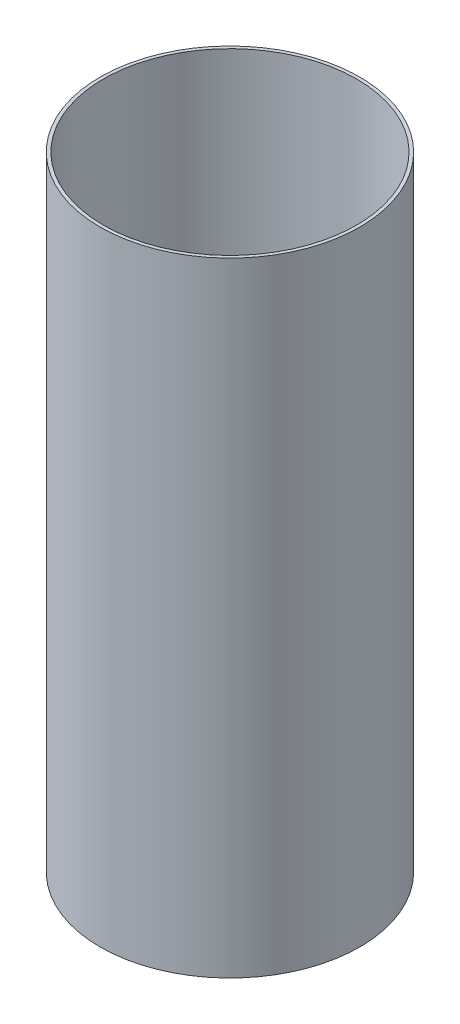
ISO-10303-21;
HEADER;
FILE_DESCRIPTION(('STEP AP214'),'2;1');
FILE_NAME('part.step','',(''),(''),'','','');
FILE_SCHEMA(('AUTOMOTIVE_DESIGN { 1 0 10303 214 1 1 1 1 }'));
ENDSEC;
DATA;
#1=APPLICATION_CONTEXT('core data for automotive mechanical design processes');
#2=APPLICATION_PROTOCOL_DEFINITION('international standard','automotive_design',2000,#1);
#3=PRODUCT_CONTEXT('',#1,'mechanical');
#4=PRODUCT('Part','Part','',(#3));
#5=PRODUCT_RELATED_PRODUCT_CATEGORY('part','',(#4));
#6=PRODUCT_DEFINITION_FORMATION('','',#4);
#7=PRODUCT_DEFINITION_CONTEXT('part definition',#1,'design');
#8=PRODUCT_DEFINITION('design','',#6,#7);
#9=PRODUCT_DEFINITION_SHAPE('','',#8);
#10=(LENGTH_UNIT() NAMED_UNIT(*) SI_UNIT(.MILLI.,.METRE.));
#11=(NAMED_UNIT(*) PLANE_ANGLE_UNIT() SI_UNIT($,.RADIAN.));
#12=(NAMED_UNIT(*) SI_UNIT($,.STERADIAN.) SOLID_ANGLE_UNIT());
#13=UNCERTAINTY_MEASURE_WITH_UNIT(LENGTH_MEASURE(1.E-05),#10,'distance_accuracy_value','');
#14=(GEOMETRIC_REPRESENTATION_CONTEXT(3) GLOBAL_UNCERTAINTY_ASSIGNED_CONTEXT((#13)) GLOBAL_UNIT_ASSIGNED_CONTEXT((#10,
#11,#12)) REPRESENTATION_CONTEXT('',''));
#15=CARTESIAN_POINT('',(0.,0.,0.));
#16=DIRECTION('',(0.,0.,1.));
#17=DIRECTION('',(1.,0.,0.));
#18=AXIS2_PLACEMENT_3D('',#15,#16,#17);
#19=CARTESIAN_POINT('',(0.,-304.8,0.));
#20=DIRECTION('',(0.,1.,0.));
#21=DIRECTION('',(0.,0.,1.));
#22=AXIS2_PLACEMENT_3D('',#19,#20,#21);
#23=CYLINDRICAL_SURFACE('',#22,127.);
#24=CARTESIAN_POINT('',(0.,-304.8,0.));
#25=DIRECTION('',(0.,1.,0.));
#26=DIRECTION('',(0.,0.,1.));
#27=AXIS2_PLACEMENT_3D('',#24,#25,#26);
#28=CIRCLE('',#27,127.);
#29=CARTESIAN_POINT('',(0.,-304.8,127.));
#30=VERTEX_POINT('',#29);
#31=EDGE_CURVE('E10',#30,#30,#28,.T.);
#32=ORIENTED_EDGE('',*,*,#31,.T.);
#33=EDGE_LOOP('',(#32));
#34=FACE_BOUND('',#33,.T.);
#35=CARTESIAN_POINT('',(0.,304.8,0.));
#36=DIRECTION('',(0.,1.,0.));
#37=DIRECTION('',(0.,0.,1.));
#38=AXIS2_PLACEMENT_3D('',#35,#36,#37);
#39=CIRCLE('',#38,127.);
#40=CARTESIAN_POINT('',(0.,304.8,127.));
#41=VERTEX_POINT('',#40);
#42=EDGE_CURVE('E43',#41,#41,#39,.T.);
#43=ORIENTED_EDGE('',*,*,#42,.F.);
#44=EDGE_LOOP('',(#43));
#45=FACE_BOUND('',#44,.T.);
#46=ADVANCED_FACE('F33',(#34,#45),#23,.T.);
#47=CARTESIAN_POINT('',(0.,-304.8,0.));
#48=DIRECTION('',(0.,1.,0.));
#49=DIRECTION('',(0.,0.,1.));
#50=AXIS2_PLACEMENT_3D('',#47,#48,#49);
#51=PLANE('',#50);
#52=CARTESIAN_POINT('',(0.,-304.8,0.));
#53=DIRECTION('',(0.,1.,0.));
#54=DIRECTION('',(0.,0.,1.));
#55=AXIS2_PLACEMENT_3D('',#52,#53,#54);
#56=CIRCLE('',#55,123.825);
#57=CARTESIAN_POINT('',(0.,-304.8,123.825));
#58=VERTEX_POINT('',#57);
#59=EDGE_CURVE('E39',#58,#58,#56,.T.);
#60=ORIENTED_EDGE('',*,*,#59,.T.);
#61=EDGE_LOOP('',(#60));
#62=FACE_BOUND('',#61,.T.);
#63=ORIENTED_EDGE('',*,*,#31,.F.);
#64=EDGE_LOOP('',(#63));
#65=FACE_BOUND('',#64,.T.);
#66=ADVANCED_FACE('F62',(#62,#65),#51,.F.);
#67=CARTESIAN_POINT('',(0.,-304.8,0.));
#68=DIRECTION('',(0.,1.,0.));
#69=DIRECTION('',(0.,0.,1.));
#70=AXIS2_PLACEMENT_3D('',#67,#68,#69);
#71=CYLINDRICAL_SURFACE('',#70,123.825);
#72=ORIENTED_EDGE('',*,*,#59,.F.);
#73=EDGE_LOOP('',(#72));
#74=FACE_BOUND('',#73,.T.);
#75=CARTESIAN_POINT('',(0.,304.8,0.));
#76=DIRECTION('',(0.,1.,0.));
#77=DIRECTION('',(0.,0.,1.));
#78=AXIS2_PLACEMENT_3D('',#75,#76,#77);
#79=CIRCLE('',#78,123.825);
#80=CARTESIAN_POINT('',(0.,304.8,123.825));
#81=VERTEX_POINT('',#80);
#82=EDGE_CURVE('E47',#81,#81,#79,.T.);
#83=ORIENTED_EDGE('',*,*,#82,.T.);
#84=EDGE_LOOP('',(#83));
#85=FACE_BOUND('',#84,.T.);
#86=ADVANCED_FACE('F53',(#74,#85),#71,.F.);
#87=CARTESIAN_POINT('',(0.,304.8,0.));
#88=DIRECTION('',(0.,1.,0.));
#89=DIRECTION('',(0.,0.,1.));
#90=AXIS2_PLACEMENT_3D('',#87,#88,#89);
#91=PLANE('',#90);
#92=ORIENTED_EDGE('',*,*,#42,.T.);
#93=EDGE_LOOP('',(#92));
#94=FACE_BOUND('',#93,.T.);
#95=ORIENTED_EDGE('',*,*,#82,.F.);
#96=EDGE_LOOP('',(#95));
#97=FACE_BOUND('',#96,.T.);
#98=ADVANCED_FACE('F55',(#94,#97),#91,.T.);
#99=CLOSED_SHELL('',(#46,#66,#86,#98));
#100=MANIFOLD_SOLID_BREP('B2',#99);
#101=ADVANCED_BREP_SHAPE_REPRESENTATION('',(#18,#100),#14);
#102=SHAPE_DEFINITION_REPRESENTATION(#9,#101);
ENDSEC;
END-ISO-10303-21;
